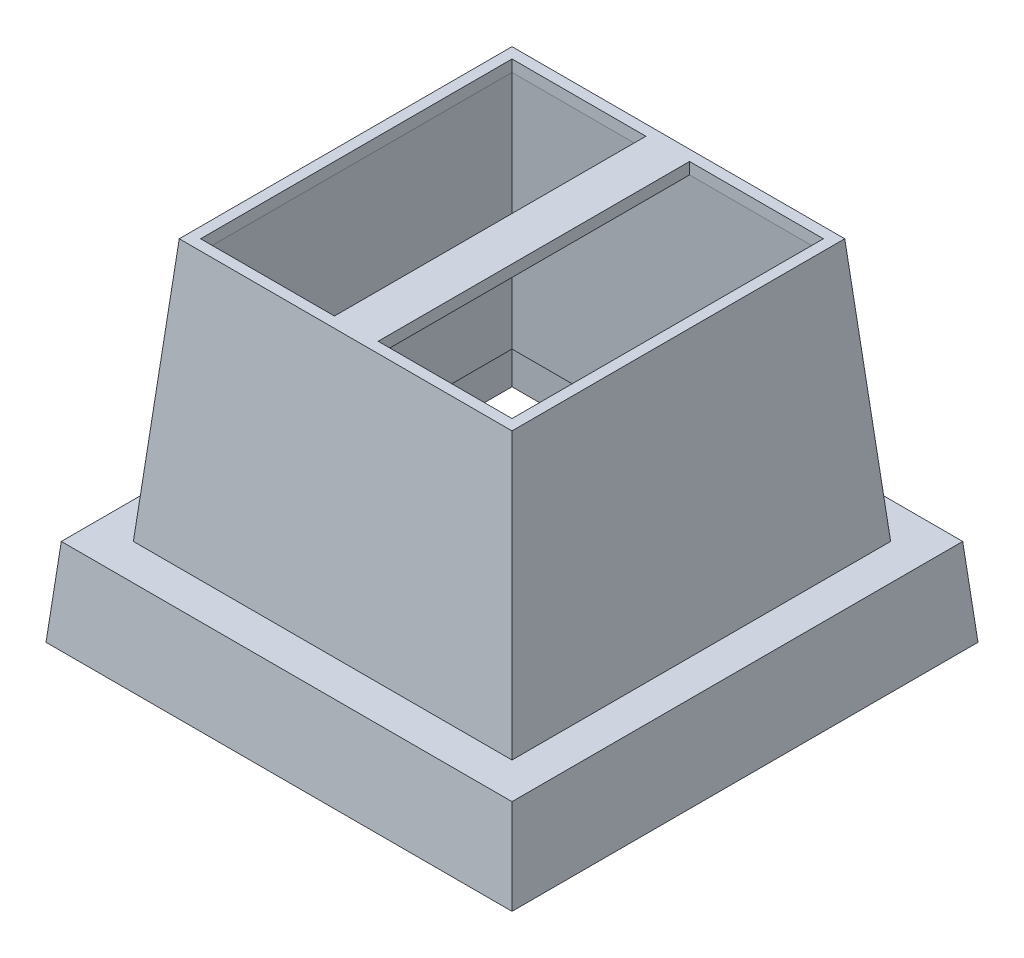
ISO-10303-21;
HEADER;
FILE_DESCRIPTION(('STEP AP214'),'2;1');
FILE_NAME('part.step','',(''),(''),'','','');
FILE_SCHEMA(('AUTOMOTIVE_DESIGN { 1 0 10303 214 1 1 1 1 }'));
ENDSEC;
DATA;
#1=APPLICATION_CONTEXT('core data for automotive mechanical design processes');
#2=APPLICATION_PROTOCOL_DEFINITION('international standard','automotive_design',2000,#1);
#3=PRODUCT_CONTEXT('',#1,'mechanical');
#4=PRODUCT('Part','Part','',(#3));
#5=PRODUCT_RELATED_PRODUCT_CATEGORY('part','',(#4));
#6=PRODUCT_DEFINITION_FORMATION('','',#4);
#7=PRODUCT_DEFINITION_CONTEXT('part definition',#1,'design');
#8=PRODUCT_DEFINITION('design','',#6,#7);
#9=PRODUCT_DEFINITION_SHAPE('','',#8);
#10=(LENGTH_UNIT() NAMED_UNIT(*) SI_UNIT(.MILLI.,.METRE.));
#11=(NAMED_UNIT(*) PLANE_ANGLE_UNIT() SI_UNIT($,.RADIAN.));
#12=(NAMED_UNIT(*) SI_UNIT($,.STERADIAN.) SOLID_ANGLE_UNIT());
#13=UNCERTAINTY_MEASURE_WITH_UNIT(LENGTH_MEASURE(1.E-05),#10,'distance_accuracy_value','');
#14=(GEOMETRIC_REPRESENTATION_CONTEXT(3) GLOBAL_UNCERTAINTY_ASSIGNED_CONTEXT((#13)) GLOBAL_UNIT_ASSIGNED_CONTEXT((#10,
#11,#12)) REPRESENTATION_CONTEXT('',''));
#15=CARTESIAN_POINT('',(0.,0.,0.));
#16=DIRECTION('',(0.,0.,1.));
#17=DIRECTION('',(1.,0.,0.));
#18=AXIS2_PLACEMENT_3D('',#15,#16,#17);
#19=CARTESIAN_POINT('',(0.,23.2,0.));
#20=DIRECTION('',(0.,1.,0.));
#21=DIRECTION('',(0.,0.,1.));
#22=AXIS2_PLACEMENT_3D('',#19,#20,#21);
#23=PLANE('',#22);
#24=DIRECTION('',(-1.,0.,0.));
#25=VECTOR('',#24,1.);
#26=CARTESIAN_POINT('',(-29.,23.2,-5.30786088268058));
#27=LINE('',#26,#25);
#28=CARTESIAN_POINT('',(-17.5,23.2,-5.30786088268058));
#29=VERTEX_POINT('',#28);
#30=CARTESIAN_POINT('',(-14.5,23.2,-5.30786088268058));
#31=VERTEX_POINT('',#30);
#32=EDGE_CURVE('E264',#29,#31,#27,.F.);
#33=ORIENTED_EDGE('',*,*,#32,.F.);
#34=DIRECTION('',(0.,0.,-1.));
#35=VECTOR('',#34,1.);
#36=CARTESIAN_POINT('',(-17.5,23.2,0.));
#37=LINE('',#36,#35);
#38=CARTESIAN_POINT('',(-17.5,23.2,-26.6921391173194));
#39=VERTEX_POINT('',#38);
#40=EDGE_CURVE('E193',#29,#39,#37,.T.);
#41=ORIENTED_EDGE('',*,*,#40,.T.);
#42=DIRECTION('',(1.,0.,0.));
#43=VECTOR('',#42,1.);
#44=CARTESIAN_POINT('',(-29.,23.2,-26.6921391173194));
#45=LINE('',#44,#43);
#46=CARTESIAN_POINT('',(-14.5,23.2,-26.6921391173194));
#47=VERTEX_POINT('',#46);
#48=EDGE_CURVE('E277',#47,#39,#45,.F.);
#49=ORIENTED_EDGE('',*,*,#48,.F.);
#50=DIRECTION('',(0.,0.,-1.));
#51=VECTOR('',#50,1.);
#52=CARTESIAN_POINT('',(-14.5,23.2,0.));
#53=LINE('',#52,#51);
#54=EDGE_CURVE('E228',#31,#47,#53,.T.);
#55=ORIENTED_EDGE('',*,*,#54,.F.);
#56=EDGE_LOOP('',(#33,#41,#49,#55));
#57=FACE_BOUND('',#56,.T.);
#58=ADVANCED_FACE('F35',(#57),#23,.F.);
#59=CARTESIAN_POINT('',(0.,24.,0.));
#60=DIRECTION('',(0.,1.,0.));
#61=DIRECTION('',(0.,0.,1.));
#62=AXIS2_PLACEMENT_3D('',#59,#60,#61);
#63=PLANE('',#62);
#64=DIRECTION('',(-1.,0.,0.));
#65=VECTOR('',#64,1.);
#66=CARTESIAN_POINT('',(0.,24.,-5.30786088268058));
#67=LINE('',#66,#65);
#68=CARTESIAN_POINT('',(-5.30786088268057,24.,-5.30786088268058));
#69=VERTEX_POINT('',#68);
#70=CARTESIAN_POINT('',(-14.5,24.,-5.30786088268058));
#71=VERTEX_POINT('',#70);
#72=EDGE_CURVE('E224',#69,#71,#67,.T.);
#73=ORIENTED_EDGE('',*,*,#72,.T.);
#74=DIRECTION('',(0.,0.,-1.));
#75=VECTOR('',#74,1.);
#76=CARTESIAN_POINT('',(-14.5,24.,0.));
#77=LINE('',#76,#75);
#78=CARTESIAN_POINT('',(-14.5,24.,-26.6921391173194));
#79=VERTEX_POINT('',#78);
#80=EDGE_CURVE('E227',#71,#79,#77,.T.);
#81=ORIENTED_EDGE('',*,*,#80,.T.);
#82=DIRECTION('',(1.,0.,0.));
#83=VECTOR('',#82,1.);
#84=CARTESIAN_POINT('',(0.,24.,-26.6921391173194));
#85=LINE('',#84,#83);
#86=CARTESIAN_POINT('',(-5.30786088268058,24.,-26.6921391173194));
#87=VERTEX_POINT('',#86);
#88=EDGE_CURVE('E231',#79,#87,#85,.T.);
#89=ORIENTED_EDGE('',*,*,#88,.T.);
#90=DIRECTION('',(0.,0.,1.));
#91=VECTOR('',#90,1.);
#92=CARTESIAN_POINT('',(-5.30786088268057,24.,0.));
#93=LINE('',#92,#91);
#94=EDGE_CURVE('E234',#87,#69,#93,.T.);
#95=ORIENTED_EDGE('',*,*,#94,.T.);
#96=EDGE_LOOP('',(#73,#81,#89,#95));
#97=FACE_BOUND('',#96,.T.);
#98=DIRECTION('',(0.,0.,-1.));
#99=VECTOR('',#98,1.);
#100=CARTESIAN_POINT('',(-27.4252040565334,24.,-29.));
#101=LINE('',#100,#99);
#102=CARTESIAN_POINT('',(-27.4252040565334,24.,-27.4252040565334));
#103=VERTEX_POINT('',#102);
#104=CARTESIAN_POINT('',(-27.4252040565334,24.,-4.57479594346664));
#105=VERTEX_POINT('',#104);
#106=EDGE_CURVE('E301',#103,#105,#101,.F.);
#107=ORIENTED_EDGE('',*,*,#106,.T.);
#108=DIRECTION('',(-1.,0.,0.));
#109=VECTOR('',#108,1.);
#110=CARTESIAN_POINT('',(-29.,24.,-4.57479594346664));
#111=LINE('',#110,#109);
#112=CARTESIAN_POINT('',(-4.57479594346664,24.,-4.57479594346664));
#113=VERTEX_POINT('',#112);
#114=EDGE_CURVE('E318',#105,#113,#111,.F.);
#115=ORIENTED_EDGE('',*,*,#114,.T.);
#116=DIRECTION('',(0.,0.,1.));
#117=VECTOR('',#116,1.);
#118=CARTESIAN_POINT('',(-4.57479594346664,24.,-29.));
#119=LINE('',#118,#117);
#120=CARTESIAN_POINT('',(-4.57479594346664,24.,-27.4252040565334));
#121=VERTEX_POINT('',#120);
#122=EDGE_CURVE('E320',#113,#121,#119,.F.);
#123=ORIENTED_EDGE('',*,*,#122,.T.);
#124=DIRECTION('',(1.,0.,0.));
#125=VECTOR('',#124,1.);
#126=CARTESIAN_POINT('',(-29.,24.,-27.4252040565334));
#127=LINE('',#126,#125);
#128=EDGE_CURVE('E311',#121,#103,#127,.F.);
#129=ORIENTED_EDGE('',*,*,#128,.T.);
#130=EDGE_LOOP('',(#107,#115,#123,#129));
#131=FACE_BOUND('',#130,.T.);
#132=DIRECTION('',(1.,0.,0.));
#133=VECTOR('',#132,1.);
#134=CARTESIAN_POINT('',(0.,24.,-26.6921391173194));
#135=LINE('',#134,#133);
#136=CARTESIAN_POINT('',(-26.6921391173194,24.,-26.6921391173194));
#137=VERTEX_POINT('',#136);
#138=CARTESIAN_POINT('',(-17.5,24.,-26.6921391173194));
#139=VERTEX_POINT('',#138);
#140=EDGE_CURVE('E198',#137,#139,#135,.T.);
#141=ORIENTED_EDGE('',*,*,#140,.T.);
#142=DIRECTION('',(0.,0.,-1.));
#143=VECTOR('',#142,1.);
#144=CARTESIAN_POINT('',(-17.5,24.,0.));
#145=LINE('',#144,#143);
#146=CARTESIAN_POINT('',(-17.5,24.,-5.30786088268058));
#147=VERTEX_POINT('',#146);
#148=EDGE_CURVE('E191',#147,#139,#145,.T.);
#149=ORIENTED_EDGE('',*,*,#148,.F.);
#150=DIRECTION('',(-1.,0.,0.));
#151=VECTOR('',#150,1.);
#152=CARTESIAN_POINT('',(0.,24.,-5.30786088268058));
#153=LINE('',#152,#151);
#154=CARTESIAN_POINT('',(-26.6921391173194,24.,-5.30786088268058));
#155=VERTEX_POINT('',#154);
#156=EDGE_CURVE('E202',#147,#155,#153,.T.);
#157=ORIENTED_EDGE('',*,*,#156,.T.);
#158=DIRECTION('',(0.,0.,-1.));
#159=VECTOR('',#158,1.);
#160=CARTESIAN_POINT('',(-26.6921391173194,24.,0.));
#161=LINE('',#160,#159);
#162=EDGE_CURVE('E206',#155,#137,#161,.T.);
#163=ORIENTED_EDGE('',*,*,#162,.T.);
#164=EDGE_LOOP('',(#141,#149,#157,#163));
#165=FACE_BOUND('',#164,.T.);
#166=ADVANCED_FACE('F209',(#97,#131,#165),#63,.T.);
#167=CARTESIAN_POINT('',(0.,0.,0.));
#168=DIRECTION('',(0.996194698091746,0.0871557427476582,0.));
#169=DIRECTION('',(-0.0871557427476582,0.996194698091746,0.));
#170=AXIS2_PLACEMENT_3D('',#167,#168,#169);
#171=PLANE('',#170);
#172=DIRECTION('',(0.,0.,-1.));
#173=VECTOR('',#172,1.);
#174=CARTESIAN_POINT('',(0.,0.,0.));
#175=LINE('',#174,#173);
#176=CARTESIAN_POINT('',(0.,0.,0.));
#177=VERTEX_POINT('',#176);
#178=CARTESIAN_POINT('',(0.,0.,-32.));
#179=VERTEX_POINT('',#178);
#180=EDGE_CURVE('E305',#177,#179,#175,.T.);
#181=ORIENTED_EDGE('',*,*,#180,.T.);
#182=DIRECTION('',(0.0868265938642476,-0.992432509138967,-0.0868265938642477));
#183=VECTOR('',#182,1.);
#184=CARTESIAN_POINT('',(0.,0.,-32.));
#185=LINE('',#184,#183);
#186=CARTESIAN_POINT('',(-0.524931981155544,6.,-31.4750680188445));
#187=VERTEX_POINT('',#186);
#188=EDGE_CURVE('E332',#187,#179,#185,.T.);
#189=ORIENTED_EDGE('',*,*,#188,.F.);
#190=DIRECTION('',(0.,0.,1.));
#191=VECTOR('',#190,1.);
#192=CARTESIAN_POINT('',(-0.524931981155544,6.,0.));
#193=LINE('',#192,#191);
#194=CARTESIAN_POINT('',(-0.524931981155544,6.,-0.524931981155544));
#195=VERTEX_POINT('',#194);
#196=EDGE_CURVE('E331',#195,#187,#193,.F.);
#197=ORIENTED_EDGE('',*,*,#196,.F.);
#198=DIRECTION('',(0.0868265938642476,-0.992432509138967,0.0868265938642476));
#199=VECTOR('',#198,1.);
#200=CARTESIAN_POINT('',(0.,0.,0.));
#201=LINE('',#200,#199);
#202=EDGE_CURVE('E337',#195,#177,#201,.T.);
#203=ORIENTED_EDGE('',*,*,#202,.T.);
#204=EDGE_LOOP('',(#181,#189,#197,#203));
#205=FACE_BOUND('',#204,.T.);
#206=ADVANCED_FACE('F438',(#205),#171,.T.);
#207=CARTESIAN_POINT('',(0.,0.,-32.));
#208=DIRECTION('',(0.,0.0871557427476582,-0.996194698091746));
#209=DIRECTION('',(0.,0.996194698091746,0.0871557427476582));
#210=AXIS2_PLACEMENT_3D('',#207,#208,#209);
#211=PLANE('',#210);
#212=DIRECTION('',(-1.,0.,0.));
#213=VECTOR('',#212,1.);
#214=CARTESIAN_POINT('',(0.,0.,-32.));
#215=LINE('',#214,#213);
#216=CARTESIAN_POINT('',(-32.,0.,-32.));
#217=VERTEX_POINT('',#216);
#218=EDGE_CURVE('E325',#179,#217,#215,.T.);
#219=ORIENTED_EDGE('',*,*,#218,.T.);
#220=DIRECTION('',(-0.0868265938642476,-0.992432509138967,-0.0868265938642476));
#221=VECTOR('',#220,1.);
#222=CARTESIAN_POINT('',(-31.7587565631339,2.75742510107793,-31.7587565631339));
#223=LINE('',#222,#221);
#224=CARTESIAN_POINT('',(-31.4750680188445,6.,-31.4750680188445));
#225=VERTEX_POINT('',#224);
#226=EDGE_CURVE('E336',#225,#217,#223,.T.);
#227=ORIENTED_EDGE('',*,*,#226,.F.);
#228=DIRECTION('',(1.,0.,0.));
#229=VECTOR('',#228,1.);
#230=CARTESIAN_POINT('',(0.,6.,-31.4750680188445));
#231=LINE('',#230,#229);
#232=EDGE_CURVE('E348',#187,#225,#231,.F.);
#233=ORIENTED_EDGE('',*,*,#232,.F.);
#234=ORIENTED_EDGE('',*,*,#188,.T.);
#235=EDGE_LOOP('',(#219,#227,#233,#234));
#236=FACE_BOUND('',#235,.T.);
#237=ADVANCED_FACE('F468',(#236),#211,.T.);
#238=CARTESIAN_POINT('',(-32.,0.,0.));
#239=DIRECTION('',(-0.996194698091746,0.0871557427476582,0.));
#240=DIRECTION('',(-0.0871557427476582,-0.996194698091746,0.));
#241=AXIS2_PLACEMENT_3D('',#238,#239,#240);
#242=PLANE('',#241);
#243=DIRECTION('',(0.,0.,1.));
#244=VECTOR('',#243,1.);
#245=CARTESIAN_POINT('',(-32.,0.,0.));
#246=LINE('',#245,#244);
#247=CARTESIAN_POINT('',(-32.,0.,0.));
#248=VERTEX_POINT('',#247);
#249=EDGE_CURVE('E327',#217,#248,#246,.T.);
#250=ORIENTED_EDGE('',*,*,#249,.T.);
#251=DIRECTION('',(-0.0868265938642476,-0.992432509138967,0.0868265938642476));
#252=VECTOR('',#251,1.);
#253=CARTESIAN_POINT('',(-31.7587565631339,2.75742510107793,-0.241243436866144));
#254=LINE('',#253,#252);
#255=CARTESIAN_POINT('',(-31.4750680188445,6.,-0.524931981155544));
#256=VERTEX_POINT('',#255);
#257=EDGE_CURVE('E340',#256,#248,#254,.T.);
#258=ORIENTED_EDGE('',*,*,#257,.F.);
#259=DIRECTION('',(0.,0.,-1.));
#260=VECTOR('',#259,1.);
#261=CARTESIAN_POINT('',(-31.4750680188445,6.,0.));
#262=LINE('',#261,#260);
#263=EDGE_CURVE('E350',#225,#256,#262,.F.);
#264=ORIENTED_EDGE('',*,*,#263,.F.);
#265=ORIENTED_EDGE('',*,*,#226,.T.);
#266=EDGE_LOOP('',(#250,#258,#264,#265));
#267=FACE_BOUND('',#266,.T.);
#268=ADVANCED_FACE('F472',(#267),#242,.T.);
#269=CARTESIAN_POINT('',(0.,0.,0.));
#270=DIRECTION('',(0.,0.0871557427476582,0.996194698091746));
#271=DIRECTION('',(0.,-0.996194698091746,0.0871557427476582));
#272=AXIS2_PLACEMENT_3D('',#269,#270,#271);
#273=PLANE('',#272);
#274=DIRECTION('',(1.,0.,0.));
#275=VECTOR('',#274,1.);
#276=CARTESIAN_POINT('',(0.,0.,0.));
#277=LINE('',#276,#275);
#278=EDGE_CURVE('E329',#248,#177,#277,.T.);
#279=ORIENTED_EDGE('',*,*,#278,.T.);
#280=ORIENTED_EDGE('',*,*,#202,.F.);
#281=DIRECTION('',(-1.,0.,0.));
#282=VECTOR('',#281,1.);
#283=CARTESIAN_POINT('',(0.,6.,-0.524931981155544));
#284=LINE('',#283,#282);
#285=EDGE_CURVE('E341',#256,#195,#284,.F.);
#286=ORIENTED_EDGE('',*,*,#285,.F.);
#287=ORIENTED_EDGE('',*,*,#257,.T.);
#288=EDGE_LOOP('',(#279,#280,#286,#287));
#289=FACE_BOUND('',#288,.T.);
#290=ADVANCED_FACE('F462',(#289),#273,.T.);
#291=CARTESIAN_POINT('',(0.,6.,0.));
#292=DIRECTION('',(0.,1.,0.));
#293=DIRECTION('',(0.,0.,1.));
#294=AXIS2_PLACEMENT_3D('',#291,#292,#293);
#295=PLANE('',#294);
#296=DIRECTION('',(0.,0.,1.));
#297=VECTOR('',#296,1.);
#298=CARTESIAN_POINT('',(-29.,6.,-29.));
#299=LINE('',#298,#297);
#300=CARTESIAN_POINT('',(-29.,6.,-29.));
#301=VERTEX_POINT('',#300);
#302=CARTESIAN_POINT('',(-29.,6.,-3.00000000000001));
#303=VERTEX_POINT('',#302);
#304=EDGE_CURVE('E249',#301,#303,#299,.T.);
#305=ORIENTED_EDGE('',*,*,#304,.F.);
#306=DIRECTION('',(-1.,0.,0.));
#307=VECTOR('',#306,1.);
#308=CARTESIAN_POINT('',(-29.,6.,-29.));
#309=LINE('',#308,#307);
#310=CARTESIAN_POINT('',(-3.,6.,-29.));
#311=VERTEX_POINT('',#310);
#312=EDGE_CURVE('E298',#311,#301,#309,.T.);
#313=ORIENTED_EDGE('',*,*,#312,.F.);
#314=DIRECTION('',(0.,0.,-1.));
#315=VECTOR('',#314,1.);
#316=CARTESIAN_POINT('',(-3.,6.,-29.));
#317=LINE('',#316,#315);
#318=CARTESIAN_POINT('',(-3.,6.,-3.00000000000001));
#319=VERTEX_POINT('',#318);
#320=EDGE_CURVE('E295',#319,#311,#317,.T.);
#321=ORIENTED_EDGE('',*,*,#320,.F.);
#322=DIRECTION('',(1.,0.,0.));
#323=VECTOR('',#322,1.);
#324=CARTESIAN_POINT('',(-29.,6.,-3.00000000000001));
#325=LINE('',#324,#323);
#326=EDGE_CURVE('E292',#303,#319,#325,.T.);
#327=ORIENTED_EDGE('',*,*,#326,.F.);
#328=EDGE_LOOP('',(#305,#313,#321,#327));
#329=FACE_BOUND('',#328,.T.);
#330=ORIENTED_EDGE('',*,*,#196,.T.);
#331=ORIENTED_EDGE('',*,*,#232,.T.);
#332=ORIENTED_EDGE('',*,*,#263,.T.);
#333=ORIENTED_EDGE('',*,*,#285,.T.);
#334=EDGE_LOOP('',(#330,#331,#332,#333));
#335=FACE_BOUND('',#334,.T.);
#336=ADVANCED_FACE('F459',(#329,#335),#295,.T.);
#337=CARTESIAN_POINT('',(0.,0.,0.));
#338=DIRECTION('',(0.,1.,0.));
#339=DIRECTION('',(0.,0.,1.));
#340=AXIS2_PLACEMENT_3D('',#337,#338,#339);
#341=PLANE('',#340);
#342=DIRECTION('',(-1.,0.,0.));
#343=VECTOR('',#342,1.);
#344=CARTESIAN_POINT('',(0.,0.,-0.803055870034678));
#345=LINE('',#344,#343);
#346=CARTESIAN_POINT('',(-31.1969441299653,0.,-0.803055870034678));
#347=VERTEX_POINT('',#346);
#348=CARTESIAN_POINT('',(-0.803055870034678,0.,-0.803055870034678));
#349=VERTEX_POINT('',#348);
#350=EDGE_CURVE('E254',#347,#349,#345,.F.);
#351=ORIENTED_EDGE('',*,*,#350,.T.);
#352=DIRECTION('',(0.,0.,1.));
#353=VECTOR('',#352,1.);
#354=CARTESIAN_POINT('',(-0.803055870034678,0.,0.));
#355=LINE('',#354,#353);
#356=CARTESIAN_POINT('',(-0.803055870034678,0.,-31.1969441299653));
#357=VERTEX_POINT('',#356);
#358=EDGE_CURVE('E259',#349,#357,#355,.F.);
#359=ORIENTED_EDGE('',*,*,#358,.T.);
#360=DIRECTION('',(1.,0.,0.));
#361=VECTOR('',#360,1.);
#362=CARTESIAN_POINT('',(0.,0.,-31.1969441299653));
#363=LINE('',#362,#361);
#364=CARTESIAN_POINT('',(-31.1969441299653,0.,-31.1969441299653));
#365=VERTEX_POINT('',#364);
#366=EDGE_CURVE('E282',#357,#365,#363,.F.);
#367=ORIENTED_EDGE('',*,*,#366,.T.);
#368=DIRECTION('',(0.,0.,-1.));
#369=VECTOR('',#368,1.);
#370=CARTESIAN_POINT('',(-31.1969441299653,0.,0.));
#371=LINE('',#370,#369);
#372=EDGE_CURVE('E285',#365,#347,#371,.F.);
#373=ORIENTED_EDGE('',*,*,#372,.T.);
#374=EDGE_LOOP('',(#351,#359,#367,#373));
#375=FACE_BOUND('',#374,.T.);
#376=ORIENTED_EDGE('',*,*,#180,.F.);
#377=ORIENTED_EDGE('',*,*,#278,.F.);
#378=ORIENTED_EDGE('',*,*,#249,.F.);
#379=ORIENTED_EDGE('',*,*,#218,.F.);
#380=EDGE_LOOP('',(#376,#377,#378,#379));
#381=FACE_BOUND('',#380,.T.);
#382=ADVANCED_FACE('F414',(#375,#381),#341,.F.);
#383=CARTESIAN_POINT('',(-29.,6.,-29.));
#384=DIRECTION('',(-0.996194698091746,0.0871557427476582,0.));
#385=DIRECTION('',(-0.0871557427476582,-0.996194698091746,0.));
#386=AXIS2_PLACEMENT_3D('',#383,#384,#385);
#387=PLANE('',#386);
#388=ORIENTED_EDGE('',*,*,#304,.T.);
#389=DIRECTION('',(-0.0868265938642476,-0.992432509138967,0.0868265938642476));
#390=VECTOR('',#389,1.);
#391=CARTESIAN_POINT('',(-29.,6.,-3.00000000000001));
#392=LINE('',#391,#390);
#393=EDGE_CURVE('E302',#105,#303,#392,.T.);
#394=ORIENTED_EDGE('',*,*,#393,.F.);
#395=ORIENTED_EDGE('',*,*,#106,.F.);
#396=DIRECTION('',(-0.0868265938642476,-0.992432509138967,-0.0868265938642476));
#397=VECTOR('',#396,1.);
#398=CARTESIAN_POINT('',(-29.,6.,-29.));
#399=LINE('',#398,#397);
#400=EDGE_CURVE('E307',#103,#301,#399,.T.);
#401=ORIENTED_EDGE('',*,*,#400,.T.);
#402=EDGE_LOOP('',(#388,#394,#395,#401));
#403=FACE_BOUND('',#402,.T.);
#404=ADVANCED_FACE('F444',(#403),#387,.T.);
#405=CARTESIAN_POINT('',(-29.,6.,-3.00000000000001));
#406=DIRECTION('',(0.,0.0871557427476582,0.996194698091746));
#407=DIRECTION('',(0.,-0.996194698091746,0.0871557427476582));
#408=AXIS2_PLACEMENT_3D('',#405,#406,#407);
#409=PLANE('',#408);
#410=ORIENTED_EDGE('',*,*,#326,.T.);
#411=DIRECTION('',(0.0868265938642476,-0.992432509138967,0.0868265938642476));
#412=VECTOR('',#411,1.);
#413=CARTESIAN_POINT('',(-3.19601029245374,8.24040789462582,-3.19601029245375));
#414=LINE('',#413,#412);
#415=EDGE_CURVE('E306',#113,#319,#414,.T.);
#416=ORIENTED_EDGE('',*,*,#415,.F.);
#417=ORIENTED_EDGE('',*,*,#114,.F.);
#418=ORIENTED_EDGE('',*,*,#393,.T.);
#419=EDGE_LOOP('',(#410,#416,#417,#418));
#420=FACE_BOUND('',#419,.T.);
#421=ADVANCED_FACE('F447',(#420),#409,.T.);
#422=CARTESIAN_POINT('',(-3.,6.,-29.));
#423=DIRECTION('',(0.996194698091745,0.0871557427476582,0.));
#424=DIRECTION('',(-0.0871557427476582,0.996194698091746,0.));
#425=AXIS2_PLACEMENT_3D('',#422,#423,#424);
#426=PLANE('',#425);
#427=ORIENTED_EDGE('',*,*,#320,.T.);
#428=DIRECTION('',(0.0868265938642476,-0.992432509138967,-0.0868265938642476));
#429=VECTOR('',#428,1.);
#430=CARTESIAN_POINT('',(-3.19601029245374,8.24040789462582,-28.8039897075463));
#431=LINE('',#430,#429);
#432=EDGE_CURVE('E310',#121,#311,#431,.T.);
#433=ORIENTED_EDGE('',*,*,#432,.F.);
#434=ORIENTED_EDGE('',*,*,#122,.F.);
#435=ORIENTED_EDGE('',*,*,#415,.T.);
#436=EDGE_LOOP('',(#427,#433,#434,#435));
#437=FACE_BOUND('',#436,.T.);
#438=ADVANCED_FACE('F451',(#437),#426,.T.);
#439=CARTESIAN_POINT('',(-29.,6.,-29.));
#440=DIRECTION('',(0.,0.0871557427476582,-0.996194698091745));
#441=DIRECTION('',(0.,0.996194698091746,0.0871557427476582));
#442=AXIS2_PLACEMENT_3D('',#439,#440,#441);
#443=PLANE('',#442);
#444=ORIENTED_EDGE('',*,*,#312,.T.);
#445=ORIENTED_EDGE('',*,*,#400,.F.);
#446=ORIENTED_EDGE('',*,*,#128,.F.);
#447=ORIENTED_EDGE('',*,*,#432,.T.);
#448=EDGE_LOOP('',(#444,#445,#446,#447));
#449=FACE_BOUND('',#448,.T.);
#450=ADVANCED_FACE('F429',(#449),#443,.T.);
#451=CARTESIAN_POINT('',(-0.796955758473397,-0.0697245941981266,0.));
#452=DIRECTION('',(0.996194698091746,0.0871557427476582,0.));
#453=DIRECTION('',(-0.0871557427476582,0.996194698091746,0.));
#454=AXIS2_PLACEMENT_3D('',#451,#452,#453);
#455=PLANE('',#454);
#456=DIRECTION('',(0.0868265938642476,-0.992432509138967,0.0868265938642476));
#457=VECTOR('',#456,1.);
#458=CARTESIAN_POINT('',(-0.790947622654509,-0.1383979008501,-0.790947622654509));
#459=LINE('',#458,#457);
#460=CARTESIAN_POINT('',(-1.01830492962672,2.46030800925719,-1.01830492962672));
#461=VERTEX_POINT('',#460);
#462=EDGE_CURVE('E251',#461,#349,#459,.T.);
#463=ORIENTED_EDGE('',*,*,#462,.F.);
#464=DIRECTION('',(0.,0.,1.));
#465=VECTOR('',#464,1.);
#466=CARTESIAN_POINT('',(-1.01830492962672,2.46030800925719,0.));
#467=LINE('',#466,#465);
#468=CARTESIAN_POINT('',(-1.01830492962672,2.46030800925719,-30.9816950703733));
#469=VERTEX_POINT('',#468);
#470=EDGE_CURVE('E359',#461,#469,#467,.F.);
#471=ORIENTED_EDGE('',*,*,#470,.T.);
#472=DIRECTION('',(0.0868265938642476,-0.992432509138967,-0.0868265938642477));
#473=VECTOR('',#472,1.);
#474=CARTESIAN_POINT('',(-0.790947622654509,-0.1383979008501,-31.2090523773455));
#475=LINE('',#474,#473);
#476=EDGE_CURVE('E247',#469,#357,#475,.T.);
#477=ORIENTED_EDGE('',*,*,#476,.T.);
#478=ORIENTED_EDGE('',*,*,#358,.F.);
#479=EDGE_LOOP('',(#463,#471,#477,#478));
#480=FACE_BOUND('',#479,.T.);
#481=ADVANCED_FACE('F410',(#480),#455,.F.);
#482=CARTESIAN_POINT('',(0.,-0.0697245941981266,-31.2030442415266));
#483=DIRECTION('',(0.,0.0871557427476582,-0.996194698091746));
#484=DIRECTION('',(0.,0.996194698091746,0.0871557427476582));
#485=AXIS2_PLACEMENT_3D('',#482,#483,#484);
#486=PLANE('',#485);
#487=ORIENTED_EDGE('',*,*,#476,.F.);
#488=DIRECTION('',(1.,0.,0.));
#489=VECTOR('',#488,1.);
#490=CARTESIAN_POINT('',(0.,2.46030800925719,-30.9816950703733));
#491=LINE('',#490,#489);
#492=CARTESIAN_POINT('',(-30.9816950703733,2.46030800925719,-30.9816950703733));
#493=VERTEX_POINT('',#492);
#494=EDGE_CURVE('E357',#469,#493,#491,.F.);
#495=ORIENTED_EDGE('',*,*,#494,.T.);
#496=DIRECTION('',(-0.0868265938642476,-0.992432509138967,-0.0868265938642476));
#497=VECTOR('',#496,1.);
#498=CARTESIAN_POINT('',(-30.9678089404793,2.61902720022783,-30.9678089404794));
#499=LINE('',#498,#497);
#500=EDGE_CURVE('E250',#493,#365,#499,.T.);
#501=ORIENTED_EDGE('',*,*,#500,.T.);
#502=ORIENTED_EDGE('',*,*,#366,.F.);
#503=EDGE_LOOP('',(#487,#495,#501,#502));
#504=FACE_BOUND('',#503,.T.);
#505=ADVANCED_FACE('F421',(#504),#486,.F.);
#506=CARTESIAN_POINT('',(-31.2030442415266,-0.0697245941981266,0.));
#507=DIRECTION('',(-0.996194698091746,0.0871557427476582,0.));
#508=DIRECTION('',(-0.0871557427476582,-0.996194698091746,0.));
#509=AXIS2_PLACEMENT_3D('',#506,#507,#508);
#510=PLANE('',#509);
#511=ORIENTED_EDGE('',*,*,#500,.F.);
#512=DIRECTION('',(0.,0.,-1.));
#513=VECTOR('',#512,1.);
#514=CARTESIAN_POINT('',(-30.9816950703733,2.46030800925719,0.));
#515=LINE('',#514,#513);
#516=CARTESIAN_POINT('',(-30.9816950703733,2.46030800925719,-1.01830492962672));
#517=VERTEX_POINT('',#516);
#518=EDGE_CURVE('E355',#493,#517,#515,.F.);
#519=ORIENTED_EDGE('',*,*,#518,.T.);
#520=DIRECTION('',(-0.0868265938642476,-0.992432509138967,0.0868265938642476));
#521=VECTOR('',#520,1.);
#522=CARTESIAN_POINT('',(-30.9678089404794,2.61902720022783,-1.03219105952065));
#523=LINE('',#522,#521);
#524=EDGE_CURVE('E253',#517,#347,#523,.T.);
#525=ORIENTED_EDGE('',*,*,#524,.T.);
#526=ORIENTED_EDGE('',*,*,#372,.F.);
#527=EDGE_LOOP('',(#511,#519,#525,#526));
#528=FACE_BOUND('',#527,.T.);
#529=ADVANCED_FACE('F419',(#528),#510,.F.);
#530=CARTESIAN_POINT('',(0.,-0.0697245941981266,-0.796955758473397));
#531=DIRECTION('',(0.,0.0871557427476582,0.996194698091746));
#532=DIRECTION('',(0.,-0.996194698091746,0.0871557427476582));
#533=AXIS2_PLACEMENT_3D('',#530,#531,#532);
#534=PLANE('',#533);
#535=ORIENTED_EDGE('',*,*,#524,.F.);
#536=DIRECTION('',(-1.,0.,0.));
#537=VECTOR('',#536,1.);
#538=CARTESIAN_POINT('',(0.,2.46030800925719,-1.01830492962672));
#539=LINE('',#538,#537);
#540=EDGE_CURVE('E335',#517,#461,#539,.F.);
#541=ORIENTED_EDGE('',*,*,#540,.T.);
#542=ORIENTED_EDGE('',*,*,#462,.T.);
#543=ORIENTED_EDGE('',*,*,#350,.F.);
#544=EDGE_LOOP('',(#535,#541,#542,#543));
#545=FACE_BOUND('',#544,.T.);
#546=ADVANCED_FACE('F406',(#545),#534,.F.);
#547=CARTESIAN_POINT('',(-28.2030442415266,5.93027540580187,-29.));
#548=DIRECTION('',(-0.996194698091746,0.0871557427476582,0.));
#549=DIRECTION('',(-0.0871557427476582,-0.996194698091746,0.));
#550=AXIS2_PLACEMENT_3D('',#547,#548,#549);
#551=PLANE('',#550);
#552=DIRECTION('',(0.,0.,-1.));
#553=VECTOR('',#552,1.);
#554=CARTESIAN_POINT('',(-28.2693254592646,5.1726776203659,0.));
#555=LINE('',#554,#553);
#556=CARTESIAN_POINT('',(-28.2693254592646,5.1726776203659,-3.73067454073541));
#557=VERTEX_POINT('',#556);
#558=CARTESIAN_POINT('',(-28.2693254592646,5.1726776203659,-28.2693254592646));
#559=VERTEX_POINT('',#558);
#560=EDGE_CURVE('E364',#557,#559,#555,.T.);
#561=ORIENTED_EDGE('',*,*,#560,.T.);
#562=DIRECTION('',(-0.0868265938642476,-0.992432509138967,-0.0868265938642476));
#563=VECTOR('',#562,1.);
#564=CARTESIAN_POINT('',(-28.2090523773455,5.8616020991499,-28.2090523773455));
#565=LINE('',#564,#563);
#566=CARTESIAN_POINT('',(-26.6921391173194,23.2,-26.6921391173194));
#567=VERTEX_POINT('',#566);
#568=EDGE_CURVE('E265',#567,#559,#565,.T.);
#569=ORIENTED_EDGE('',*,*,#568,.F.);
#570=DIRECTION('',(0.,0.,-1.));
#571=VECTOR('',#570,1.);
#572=CARTESIAN_POINT('',(-26.6921391173194,23.2,-29.));
#573=LINE('',#572,#571);
#574=CARTESIAN_POINT('',(-26.6921391173194,23.2,-5.30786088268058));
#575=VERTEX_POINT('',#574);
#576=EDGE_CURVE('E261',#567,#575,#573,.F.);
#577=ORIENTED_EDGE('',*,*,#576,.T.);
#578=DIRECTION('',(-0.0868265938642476,-0.992432509138967,0.0868265938642476));
#579=VECTOR('',#578,1.);
#580=CARTESIAN_POINT('',(-28.2090523773455,5.8616020991499,-3.79094762265451));
#581=LINE('',#580,#579);
#582=EDGE_CURVE('E257',#575,#557,#581,.T.);
#583=ORIENTED_EDGE('',*,*,#582,.T.);
#584=EDGE_LOOP('',(#561,#569,#577,#583));
#585=FACE_BOUND('',#584,.T.);
#586=ADVANCED_FACE('F394',(#585),#551,.F.);
#587=CARTESIAN_POINT('',(-29.,5.93027540580187,-3.7969557584734));
#588=DIRECTION('',(0.,0.0871557427476582,0.996194698091746));
#589=DIRECTION('',(0.,-0.996194698091746,0.0871557427476582));
#590=AXIS2_PLACEMENT_3D('',#587,#588,#589);
#591=PLANE('',#590);
#592=DIRECTION('',(0.0868265938642476,-0.992432509138967,0.0868265938642476));
#593=VECTOR('',#592,1.);
#594=CARTESIAN_POINT('',(-3.98695791510825,8.10200999377572,-3.98695791510825));
#595=LINE('',#594,#593);
#596=CARTESIAN_POINT('',(-5.30786088268057,23.2,-5.30786088268058));
#597=VERTEX_POINT('',#596);
#598=CARTESIAN_POINT('',(-3.73067454073541,5.17267762036591,-3.73067454073541));
#599=VERTEX_POINT('',#598);
#600=EDGE_CURVE('E260',#597,#599,#595,.T.);
#601=ORIENTED_EDGE('',*,*,#600,.T.);
#602=DIRECTION('',(-1.,0.,0.));
#603=VECTOR('',#602,1.);
#604=CARTESIAN_POINT('',(0.,5.17267762036591,-3.73067454073541));
#605=LINE('',#604,#603);
#606=EDGE_CURVE('E361',#599,#557,#605,.T.);
#607=ORIENTED_EDGE('',*,*,#606,.T.);
#608=ORIENTED_EDGE('',*,*,#582,.F.);
#609=EDGE_CURVE('E270',#575,#29,#27,.F.);
#610=ORIENTED_EDGE('',*,*,#609,.T.);
#611=ORIENTED_EDGE('',*,*,#32,.T.);
#612=DIRECTION('',(-1.,0.,0.));
#613=VECTOR('',#612,1.);
#614=CARTESIAN_POINT('',(0.,23.2,-5.30786088268058));
#615=LINE('',#614,#613);
#616=EDGE_CURVE('E53',#597,#31,#615,.T.);
#617=ORIENTED_EDGE('',*,*,#616,.F.);
#618=EDGE_LOOP('',(#601,#607,#608,#610,#611,#617));
#619=FACE_BOUND('',#618,.T.);
#620=ADVANCED_FACE('F506',(#619),#591,.F.);
#621=CARTESIAN_POINT('',(-3.7969557584734,5.93027540580187,-29.));
#622=DIRECTION('',(0.996194698091745,0.0871557427476582,0.));
#623=DIRECTION('',(-0.0871557427476582,0.996194698091746,0.));
#624=AXIS2_PLACEMENT_3D('',#621,#622,#623);
#625=PLANE('',#624);
#626=DIRECTION('',(0.0868265938642476,-0.992432509138967,-0.0868265938642476));
#627=VECTOR('',#626,1.);
#628=CARTESIAN_POINT('',(-3.98695791510825,8.10200999377572,-28.0130420848918));
#629=LINE('',#628,#627);
#630=CARTESIAN_POINT('',(-5.30786088268058,23.2,-26.6921391173194));
#631=VERTEX_POINT('',#630);
#632=CARTESIAN_POINT('',(-3.73067454073541,5.1726776203659,-28.2693254592646));
#633=VERTEX_POINT('',#632);
#634=EDGE_CURVE('E267',#631,#633,#629,.T.);
#635=ORIENTED_EDGE('',*,*,#634,.T.);
#636=DIRECTION('',(0.,0.,1.));
#637=VECTOR('',#636,1.);
#638=CARTESIAN_POINT('',(-3.7306745407354,5.1726776203659,0.));
#639=LINE('',#638,#637);
#640=EDGE_CURVE('E11',#633,#599,#639,.T.);
#641=ORIENTED_EDGE('',*,*,#640,.T.);
#642=ORIENTED_EDGE('',*,*,#600,.F.);
#643=DIRECTION('',(0.,0.,1.));
#644=VECTOR('',#643,1.);
#645=CARTESIAN_POINT('',(-5.30786088268058,23.2,-29.));
#646=LINE('',#645,#644);
#647=EDGE_CURVE('E273',#597,#631,#646,.F.);
#648=ORIENTED_EDGE('',*,*,#647,.T.);
#649=EDGE_LOOP('',(#635,#641,#642,#648));
#650=FACE_BOUND('',#649,.T.);
#651=ADVANCED_FACE('F502',(#650),#625,.F.);
#652=CARTESIAN_POINT('',(-29.,5.93027540580187,-28.2030442415266));
#653=DIRECTION('',(0.,0.0871557427476582,-0.996194698091745));
#654=DIRECTION('',(0.,0.996194698091746,0.0871557427476582));
#655=AXIS2_PLACEMENT_3D('',#652,#653,#654);
#656=PLANE('',#655);
#657=DIRECTION('',(1.,0.,0.));
#658=VECTOR('',#657,1.);
#659=CARTESIAN_POINT('',(0.,5.1726776203659,-28.2693254592646));
#660=LINE('',#659,#658);
#661=EDGE_CURVE('E45',#559,#633,#660,.T.);
#662=ORIENTED_EDGE('',*,*,#661,.T.);
#663=ORIENTED_EDGE('',*,*,#634,.F.);
#664=EDGE_CURVE('E268',#631,#47,#45,.F.);
#665=ORIENTED_EDGE('',*,*,#664,.T.);
#666=ORIENTED_EDGE('',*,*,#48,.T.);
#667=DIRECTION('',(1.,0.,0.));
#668=VECTOR('',#667,1.);
#669=CARTESIAN_POINT('',(0.,23.2,-26.6921391173194));
#670=LINE('',#669,#668);
#671=EDGE_CURVE('E61',#567,#39,#670,.T.);
#672=ORIENTED_EDGE('',*,*,#671,.F.);
#673=ORIENTED_EDGE('',*,*,#568,.T.);
#674=EDGE_LOOP('',(#662,#663,#665,#666,#672,#673));
#675=FACE_BOUND('',#674,.T.);
#676=ADVANCED_FACE('F390',(#675),#656,.F.);
#677=CARTESIAN_POINT('',(0.,2.46030800925719,-30.9816950703733));
#678=DIRECTION('',(0.,-0.707106781186544,0.707106781186551));
#679=DIRECTION('',(1.,0.,0.));
#680=AXIS2_PLACEMENT_3D('',#677,#678,#679);
#681=PLANE('',#680);
#682=DIRECTION('',(0.577350269189624,-0.577350269189629,-0.577350269189624));
#683=VECTOR('',#682,1.);
#684=CARTESIAN_POINT('',(-0.67886995308448,2.12087303271495,-31.3211300469155));
#685=LINE('',#684,#683);
#686=EDGE_CURVE('E372',#633,#469,#685,.T.);
#687=ORIENTED_EDGE('',*,*,#686,.F.);
#688=ORIENTED_EDGE('',*,*,#661,.F.);
#689=DIRECTION('',(-0.577350269189624,-0.577350269189629,-0.577350269189624));
#690=VECTOR('',#689,1.);
#691=CARTESIAN_POINT('',(-20.6544633802489,12.7875396993816,-20.6544633802489));
#692=LINE('',#691,#690);
#693=EDGE_CURVE('E40',#493,#559,#692,.F.);
#694=ORIENTED_EDGE('',*,*,#693,.F.);
#695=ORIENTED_EDGE('',*,*,#494,.F.);
#696=EDGE_LOOP('',(#687,#688,#694,#695));
#697=FACE_BOUND('',#696,.T.);
#698=ADVANCED_FACE('F38',(#697),#681,.T.);
#699=CARTESIAN_POINT('',(-30.9816950703733,2.46030800925719,0.));
#700=DIRECTION('',(0.707106781186551,-0.707106781186544,0.));
#701=DIRECTION('',(0.,0.,-1.));
#702=AXIS2_PLACEMENT_3D('',#699,#700,#701);
#703=PLANE('',#702);
#704=ORIENTED_EDGE('',*,*,#693,.T.);
#705=ORIENTED_EDGE('',*,*,#560,.F.);
#706=DIRECTION('',(-0.577350269189624,-0.57735026918963,0.577350269189624));
#707=VECTOR('',#706,1.);
#708=CARTESIAN_POINT('',(-20.6544633802489,12.7875396993817,-11.3455366197511));
#709=LINE('',#708,#707);
#710=EDGE_CURVE('E370',#517,#557,#709,.F.);
#711=ORIENTED_EDGE('',*,*,#710,.F.);
#712=ORIENTED_EDGE('',*,*,#518,.F.);
#713=EDGE_LOOP('',(#704,#705,#711,#712));
#714=FACE_BOUND('',#713,.T.);
#715=ADVANCED_FACE('F383',(#714),#703,.T.);
#716=CARTESIAN_POINT('',(-1.01830492962672,2.46030800925719,0.));
#717=DIRECTION('',(-0.707106781186551,-0.707106781186544,0.));
#718=DIRECTION('',(0.,0.,1.));
#719=AXIS2_PLACEMENT_3D('',#716,#717,#718);
#720=PLANE('',#719);
#721=ORIENTED_EDGE('',*,*,#686,.T.);
#722=ORIENTED_EDGE('',*,*,#470,.F.);
#723=DIRECTION('',(-0.577350269189624,0.57735026918963,-0.577350269189624));
#724=VECTOR('',#723,1.);
#725=CARTESIAN_POINT('',(-0.67886995308448,2.12087303271495,-0.67886995308448));
#726=LINE('',#725,#724);
#727=EDGE_CURVE('E220',#599,#461,#726,.F.);
#728=ORIENTED_EDGE('',*,*,#727,.F.);
#729=ORIENTED_EDGE('',*,*,#640,.F.);
#730=EDGE_LOOP('',(#721,#722,#728,#729));
#731=FACE_BOUND('',#730,.T.);
#732=ADVANCED_FACE('F487',(#731),#720,.T.);
#733=CARTESIAN_POINT('',(0.,2.46030800925719,-1.01830492962672));
#734=DIRECTION('',(0.,-0.707106781186544,-0.707106781186551));
#735=DIRECTION('',(-1.,0.,0.));
#736=AXIS2_PLACEMENT_3D('',#733,#734,#735);
#737=PLANE('',#736);
#738=ORIENTED_EDGE('',*,*,#710,.T.);
#739=ORIENTED_EDGE('',*,*,#606,.F.);
#740=ORIENTED_EDGE('',*,*,#727,.T.);
#741=ORIENTED_EDGE('',*,*,#540,.F.);
#742=EDGE_LOOP('',(#738,#739,#740,#741));
#743=FACE_BOUND('',#742,.T.);
#744=ADVANCED_FACE('F401',(#743),#737,.T.);
#745=CARTESIAN_POINT('',(0.,24.,-5.30786088268058));
#746=DIRECTION('',(0.,0.,1.));
#747=DIRECTION('',(1.,0.,0.));
#748=AXIS2_PLACEMENT_3D('',#745,#746,#747);
#749=PLANE('',#748);
#750=ORIENTED_EDGE('',*,*,#616,.T.);
#751=DIRECTION('',(0.,-1.,0.));
#752=VECTOR('',#751,1.);
#753=CARTESIAN_POINT('',(-14.5,24.,-5.30786088268058));
#754=LINE('',#753,#752);
#755=EDGE_CURVE('E237',#71,#31,#754,.T.);
#756=ORIENTED_EDGE('',*,*,#755,.F.);
#757=ORIENTED_EDGE('',*,*,#72,.F.);
#758=DIRECTION('',(0.,-1.,0.));
#759=VECTOR('',#758,1.);
#760=CARTESIAN_POINT('',(-5.30786088268057,24.,-5.30786088268058));
#761=LINE('',#760,#759);
#762=EDGE_CURVE('E216',#69,#597,#761,.T.);
#763=ORIENTED_EDGE('',*,*,#762,.T.);
#764=EDGE_LOOP('',(#750,#756,#757,#763));
#765=FACE_BOUND('',#764,.T.);
#766=ADVANCED_FACE('F486',(#765),#749,.F.);
#767=CARTESIAN_POINT('',(-5.30786088268057,24.,0.));
#768=DIRECTION('',(1.,0.,0.));
#769=DIRECTION('',(0.,0.,-1.));
#770=AXIS2_PLACEMENT_3D('',#767,#768,#769);
#771=PLANE('',#770);
#772=ORIENTED_EDGE('',*,*,#647,.F.);
#773=ORIENTED_EDGE('',*,*,#762,.F.);
#774=ORIENTED_EDGE('',*,*,#94,.F.);
#775=DIRECTION('',(0.,-1.,0.));
#776=VECTOR('',#775,1.);
#777=CARTESIAN_POINT('',(-5.30786088268058,24.,-26.6921391173194));
#778=LINE('',#777,#776);
#779=EDGE_CURVE('E242',#87,#631,#778,.T.);
#780=ORIENTED_EDGE('',*,*,#779,.T.);
#781=EDGE_LOOP('',(#772,#773,#774,#780));
#782=FACE_BOUND('',#781,.T.);
#783=ADVANCED_FACE('F574',(#782),#771,.F.);
#784=CARTESIAN_POINT('',(0.,24.,-26.6921391173194));
#785=DIRECTION('',(0.,0.,-1.));
#786=DIRECTION('',(-1.,0.,0.));
#787=AXIS2_PLACEMENT_3D('',#784,#785,#786);
#788=PLANE('',#787);
#789=ORIENTED_EDGE('',*,*,#664,.F.);
#790=ORIENTED_EDGE('',*,*,#779,.F.);
#791=ORIENTED_EDGE('',*,*,#88,.F.);
#792=DIRECTION('',(0.,-1.,0.));
#793=VECTOR('',#792,1.);
#794=CARTESIAN_POINT('',(-14.5,24.,-26.6921391173194));
#795=LINE('',#794,#793);
#796=EDGE_CURVE('E244',#79,#47,#795,.T.);
#797=ORIENTED_EDGE('',*,*,#796,.T.);
#798=EDGE_LOOP('',(#789,#790,#791,#797));
#799=FACE_BOUND('',#798,.T.);
#800=ADVANCED_FACE('F585',(#799),#788,.F.);
#801=CARTESIAN_POINT('',(-14.5,24.,0.));
#802=DIRECTION('',(-1.,0.,0.));
#803=DIRECTION('',(0.,0.,1.));
#804=AXIS2_PLACEMENT_3D('',#801,#802,#803);
#805=PLANE('',#804);
#806=ORIENTED_EDGE('',*,*,#54,.T.);
#807=ORIENTED_EDGE('',*,*,#796,.F.);
#808=ORIENTED_EDGE('',*,*,#80,.F.);
#809=ORIENTED_EDGE('',*,*,#755,.T.);
#810=EDGE_LOOP('',(#806,#807,#808,#809));
#811=FACE_BOUND('',#810,.T.);
#812=ADVANCED_FACE('F597',(#811),#805,.F.);
#813=CARTESIAN_POINT('',(-17.5,24.,0.));
#814=DIRECTION('',(-1.,0.,0.));
#815=DIRECTION('',(0.,0.,1.));
#816=AXIS2_PLACEMENT_3D('',#813,#814,#815);
#817=PLANE('',#816);
#818=ORIENTED_EDGE('',*,*,#40,.F.);
#819=DIRECTION('',(0.,-1.,0.));
#820=VECTOR('',#819,1.);
#821=CARTESIAN_POINT('',(-17.5,24.,-5.30786088268058));
#822=LINE('',#821,#820);
#823=EDGE_CURVE('E187',#147,#29,#822,.T.);
#824=ORIENTED_EDGE('',*,*,#823,.F.);
#825=ORIENTED_EDGE('',*,*,#148,.T.);
#826=DIRECTION('',(0.,-1.,0.));
#827=VECTOR('',#826,1.);
#828=CARTESIAN_POINT('',(-17.5,24.,-26.6921391173194));
#829=LINE('',#828,#827);
#830=EDGE_CURVE('E218',#139,#39,#829,.T.);
#831=ORIENTED_EDGE('',*,*,#830,.T.);
#832=EDGE_LOOP('',(#818,#824,#825,#831));
#833=FACE_BOUND('',#832,.T.);
#834=ADVANCED_FACE('F189',(#833),#817,.T.);
#835=CARTESIAN_POINT('',(0.,24.,-26.6921391173194));
#836=DIRECTION('',(0.,0.,-1.));
#837=DIRECTION('',(-1.,0.,0.));
#838=AXIS2_PLACEMENT_3D('',#835,#836,#837);
#839=PLANE('',#838);
#840=ORIENTED_EDGE('',*,*,#671,.T.);
#841=ORIENTED_EDGE('',*,*,#830,.F.);
#842=ORIENTED_EDGE('',*,*,#140,.F.);
#843=DIRECTION('',(0.,-1.,0.));
#844=VECTOR('',#843,1.);
#845=CARTESIAN_POINT('',(-26.6921391173194,24.,-26.6921391173194));
#846=LINE('',#845,#844);
#847=EDGE_CURVE('E221',#137,#567,#846,.T.);
#848=ORIENTED_EDGE('',*,*,#847,.T.);
#849=EDGE_LOOP('',(#840,#841,#842,#848));
#850=FACE_BOUND('',#849,.T.);
#851=ADVANCED_FACE('F620',(#850),#839,.F.);
#852=CARTESIAN_POINT('',(-26.6921391173194,24.,0.));
#853=DIRECTION('',(-1.,0.,0.));
#854=DIRECTION('',(0.,0.,1.));
#855=AXIS2_PLACEMENT_3D('',#852,#853,#854);
#856=PLANE('',#855);
#857=ORIENTED_EDGE('',*,*,#576,.F.);
#858=ORIENTED_EDGE('',*,*,#847,.F.);
#859=ORIENTED_EDGE('',*,*,#162,.F.);
#860=DIRECTION('',(0.,-1.,0.));
#861=VECTOR('',#860,1.);
#862=CARTESIAN_POINT('',(-26.6921391173194,24.,-5.30786088268058));
#863=LINE('',#862,#861);
#864=EDGE_CURVE('E197',#155,#575,#863,.T.);
#865=ORIENTED_EDGE('',*,*,#864,.T.);
#866=EDGE_LOOP('',(#857,#858,#859,#865));
#867=FACE_BOUND('',#866,.T.);
#868=ADVANCED_FACE('F631',(#867),#856,.F.);
#869=CARTESIAN_POINT('',(0.,24.,-5.30786088268058));
#870=DIRECTION('',(0.,0.,1.));
#871=DIRECTION('',(1.,0.,0.));
#872=AXIS2_PLACEMENT_3D('',#869,#870,#871);
#873=PLANE('',#872);
#874=ORIENTED_EDGE('',*,*,#609,.F.);
#875=ORIENTED_EDGE('',*,*,#864,.F.);
#876=ORIENTED_EDGE('',*,*,#156,.F.);
#877=ORIENTED_EDGE('',*,*,#823,.T.);
#878=EDGE_LOOP('',(#874,#875,#876,#877));
#879=FACE_BOUND('',#878,.T.);
#880=ADVANCED_FACE('F203',(#879),#873,.F.);
#881=CLOSED_SHELL('',(#58,#166,#206,#237,#268,#290,#336,#382,#404,#421,#438,#450,#481,#505,#529,
#546,#586,#620,#651,#676,#698,#715,#732,#744,#766,#783,#800,#812,#834,#851,#868,#880));
#882=MANIFOLD_SOLID_BREP('B2',#881);
#883=ADVANCED_BREP_SHAPE_REPRESENTATION('',(#18,#882),#14);
#884=SHAPE_DEFINITION_REPRESENTATION(#9,#883);
ENDSEC;
END-ISO-10303-21;
